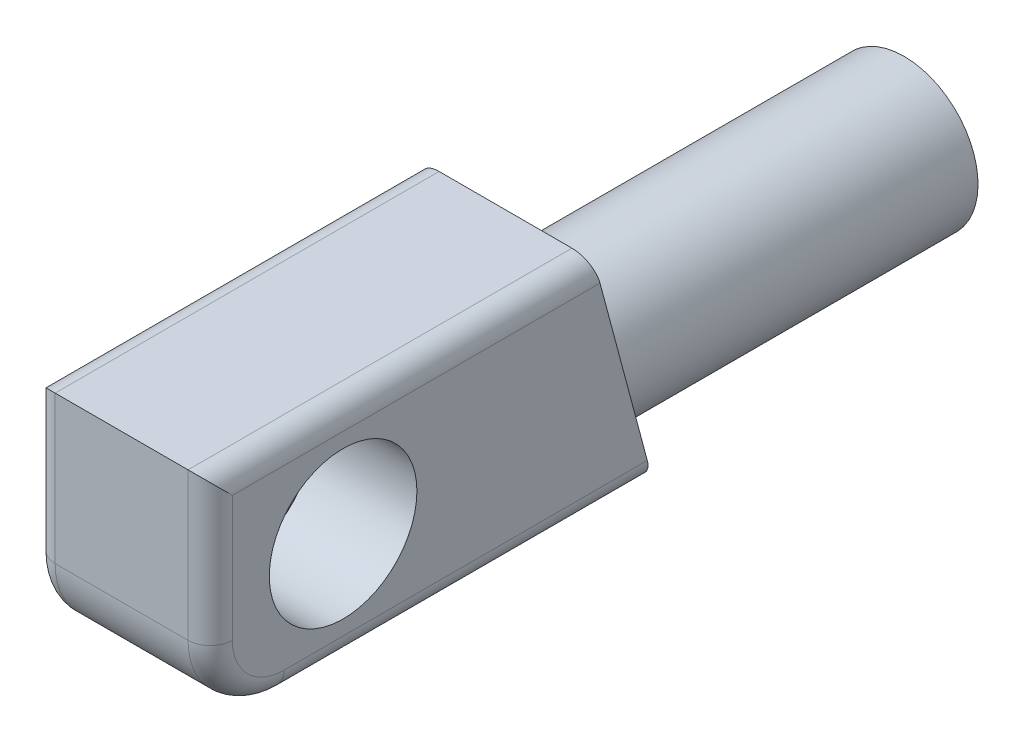
ISO-10303-21;
HEADER;
FILE_DESCRIPTION(('STEP AP214'),'2;1');
FILE_NAME('part.step','',(''),(''),'','','');
FILE_SCHEMA(('AUTOMOTIVE_DESIGN { 1 0 10303 214 1 1 1 1 }'));
ENDSEC;
DATA;
#1=APPLICATION_CONTEXT('core data for automotive mechanical design processes');
#2=APPLICATION_PROTOCOL_DEFINITION('international standard','automotive_design',2000,#1);
#3=PRODUCT_CONTEXT('',#1,'mechanical');
#4=PRODUCT('Part','Part','',(#3));
#5=PRODUCT_RELATED_PRODUCT_CATEGORY('part','',(#4));
#6=PRODUCT_DEFINITION_FORMATION('','',#4);
#7=PRODUCT_DEFINITION_CONTEXT('part definition',#1,'design');
#8=PRODUCT_DEFINITION('design','',#6,#7);
#9=PRODUCT_DEFINITION_SHAPE('','',#8);
#10=(LENGTH_UNIT() NAMED_UNIT(*) SI_UNIT(.MILLI.,.METRE.));
#11=(NAMED_UNIT(*) PLANE_ANGLE_UNIT() SI_UNIT($,.RADIAN.));
#12=(NAMED_UNIT(*) SI_UNIT($,.STERADIAN.) SOLID_ANGLE_UNIT());
#13=UNCERTAINTY_MEASURE_WITH_UNIT(LENGTH_MEASURE(1.E-05),#10,'distance_accuracy_value','');
#14=(GEOMETRIC_REPRESENTATION_CONTEXT(3) GLOBAL_UNCERTAINTY_ASSIGNED_CONTEXT((#13)) GLOBAL_UNIT_ASSIGNED_CONTEXT((#10,
#11,#12)) REPRESENTATION_CONTEXT('',''));
#15=CARTESIAN_POINT('',(0.,0.,0.));
#16=DIRECTION('',(0.,0.,1.));
#17=DIRECTION('',(1.,0.,0.));
#18=AXIS2_PLACEMENT_3D('',#15,#16,#17);
#19=CARTESIAN_POINT('',(5.99999999999999,7.50000000000001,13.0000000000001));
#20=DIRECTION('',(0.,-1.,0.));
#21=DIRECTION('',(0.,0.,-1.));
#22=AXIS2_PLACEMENT_3D('',#19,#20,#21);
#23=PLANE('',#22);
#24=DIRECTION('',(-1.,0.,0.));
#25=VECTOR('',#24,1.);
#26=CARTESIAN_POINT('',(5.99999999999999,7.50000000000001,13.0000000000001));
#27=LINE('',#26,#25);
#28=CARTESIAN_POINT('',(4.5,7.50000000000001,13.0000000000001));
#29=VERTEX_POINT('',#28);
#30=CARTESIAN_POINT('',(-4.5,7.50000000000001,13.0000000000001));
#31=VERTEX_POINT('',#30);
#32=EDGE_CURVE('E205',#29,#31,#27,.T.);
#33=ORIENTED_EDGE('',*,*,#32,.F.);
#34=DIRECTION('',(0.,0.,1.));
#35=VECTOR('',#34,1.);
#36=CARTESIAN_POINT('',(4.5,7.50000000000001,13.0000000000001));
#37=LINE('',#36,#35);
#38=CARTESIAN_POINT('',(4.5,7.50000000000013,-13.0000000000001));
#39=VERTEX_POINT('',#38);
#40=EDGE_CURVE('E13',#29,#39,#37,.F.);
#41=ORIENTED_EDGE('',*,*,#40,.T.);
#42=DIRECTION('',(-1.,0.,0.));
#43=VECTOR('',#42,1.);
#44=CARTESIAN_POINT('',(5.99999999999987,7.50000000000013,-13.));
#45=LINE('',#44,#43);
#46=CARTESIAN_POINT('',(-4.50000000000002,7.50000000000013,-13.));
#47=VERTEX_POINT('',#46);
#48=EDGE_CURVE('E197',#39,#47,#45,.T.);
#49=ORIENTED_EDGE('',*,*,#48,.T.);
#50=DIRECTION('',(0.,0.,1.));
#51=VECTOR('',#50,1.);
#52=CARTESIAN_POINT('',(-4.5,7.50000000000001,13.0000000000001));
#53=LINE('',#52,#51);
#54=EDGE_CURVE('E61',#47,#31,#53,.T.);
#55=ORIENTED_EDGE('',*,*,#54,.T.);
#56=EDGE_LOOP('',(#33,#41,#49,#55));
#57=FACE_BOUND('',#56,.T.);
#58=ADVANCED_FACE('F52',(#57),#23,.F.);
#59=CARTESIAN_POINT('',(5.99999999999999,7.50000000000001,13.0000000000001));
#60=DIRECTION('',(0.,0.,-1.));
#61=DIRECTION('',(0.,1.,0.));
#62=AXIS2_PLACEMENT_3D('',#59,#60,#61);
#63=PLANE('',#62);
#64=DIRECTION('',(-1.,0.,0.));
#65=VECTOR('',#64,1.);
#66=CARTESIAN_POINT('',(5.99999999999999,-2.49999999999999,13.0000000000001));
#67=LINE('',#66,#65);
#68=CARTESIAN_POINT('',(-4.50000000000014,-2.5,13.));
#69=VERTEX_POINT('',#68);
#70=CARTESIAN_POINT('',(4.50000000000002,-2.49999999999999,13.0000000000001));
#71=VERTEX_POINT('',#70);
#72=EDGE_CURVE('E220',#69,#71,#67,.F.);
#73=ORIENTED_EDGE('',*,*,#72,.T.);
#74=DIRECTION('',(0.,-1.,0.));
#75=VECTOR('',#74,1.);
#76=CARTESIAN_POINT('',(4.5,7.50000000000001,13.0000000000001));
#77=LINE('',#76,#75);
#78=EDGE_CURVE('E234',#71,#29,#77,.F.);
#79=ORIENTED_EDGE('',*,*,#78,.T.);
#80=ORIENTED_EDGE('',*,*,#32,.T.);
#81=DIRECTION('',(0.,-1.,0.));
#82=VECTOR('',#81,1.);
#83=CARTESIAN_POINT('',(-4.50000000000014,-2.5,13.));
#84=LINE('',#83,#82);
#85=EDGE_CURVE('E232',#31,#69,#84,.T.);
#86=ORIENTED_EDGE('',*,*,#85,.T.);
#87=EDGE_LOOP('',(#73,#79,#80,#86));
#88=FACE_BOUND('',#87,.T.);
#89=ADVANCED_FACE('F308',(#88),#63,.F.);
#90=CARTESIAN_POINT('',(5.99999999999999,-7.49999999999999,13.));
#91=DIRECTION('',(0.,1.,0.));
#92=DIRECTION('',(0.,0.,1.));
#93=AXIS2_PLACEMENT_3D('',#90,#91,#92);
#94=PLANE('',#93);
#95=DIRECTION('',(-1.,0.,0.));
#96=VECTOR('',#95,1.);
#97=CARTESIAN_POINT('',(5.99999999999987,-7.49999999999987,8.00000000000003));
#98=LINE('',#97,#96);
#99=CARTESIAN_POINT('',(4.5,-7.49999999999987,8.00000000000003));
#100=VERTEX_POINT('',#99);
#101=CARTESIAN_POINT('',(-4.50000000000013,-7.49999999999987,8.00000000000003));
#102=VERTEX_POINT('',#101);
#103=EDGE_CURVE('E217',#100,#102,#98,.T.);
#104=ORIENTED_EDGE('',*,*,#103,.T.);
#105=DIRECTION('',(0.,0.,-1.));
#106=VECTOR('',#105,1.);
#107=CARTESIAN_POINT('',(-4.5,-7.49999999999987,-17.0000000000001));
#108=LINE('',#107,#106);
#109=CARTESIAN_POINT('',(-4.5,-7.49999999999987,-17.0000000000001));
#110=VERTEX_POINT('',#109);
#111=EDGE_CURVE('E242',#102,#110,#108,.T.);
#112=ORIENTED_EDGE('',*,*,#111,.T.);
#113=DIRECTION('',(-1.,0.,0.));
#114=VECTOR('',#113,1.);
#115=CARTESIAN_POINT('',(6.00000000000013,-7.49999999999987,-17.));
#116=LINE('',#115,#114);
#117=CARTESIAN_POINT('',(-1.00000000000014,-7.49999999999987,-17.));
#118=VERTEX_POINT('',#117);
#119=EDGE_CURVE('E202',#118,#110,#116,.T.);
#120=ORIENTED_EDGE('',*,*,#119,.F.);
#121=DIRECTION('',(0.,0.,1.));
#122=VECTOR('',#121,1.);
#123=CARTESIAN_POINT('',(-1.00000000000003,-7.49999999999999,-40.0000000000001));
#124=LINE('',#123,#122);
#125=CARTESIAN_POINT('',(-1.00000000000003,-7.49999999999999,-40.0000000000001));
#126=VERTEX_POINT('',#125);
#127=EDGE_CURVE('E191',#126,#118,#124,.T.);
#128=ORIENTED_EDGE('',*,*,#127,.F.);
#129=DIRECTION('',(1.,0.,0.));
#130=VECTOR('',#129,1.);
#131=CARTESIAN_POINT('',(0.,-7.49999999999999,-40.0000000000001));
#132=LINE('',#131,#130);
#133=CARTESIAN_POINT('',(1.,-7.49999999999999,-40.0000000000001));
#134=VERTEX_POINT('',#133);
#135=EDGE_CURVE('E165',#126,#134,#132,.T.);
#136=ORIENTED_EDGE('',*,*,#135,.T.);
#137=DIRECTION('',(0.,0.,1.));
#138=VECTOR('',#137,1.);
#139=CARTESIAN_POINT('',(1.,-7.49999999999999,-40.0000000000001));
#140=LINE('',#139,#138);
#141=CARTESIAN_POINT('',(0.999999999999862,-7.49999999999987,-17.));
#142=VERTEX_POINT('',#141);
#143=EDGE_CURVE('E179',#134,#142,#140,.T.);
#144=ORIENTED_EDGE('',*,*,#143,.T.);
#145=CARTESIAN_POINT('',(4.49999999999998,-7.49999999999987,-17.));
#146=VERTEX_POINT('',#145);
#147=EDGE_CURVE('E203',#146,#142,#116,.T.);
#148=ORIENTED_EDGE('',*,*,#147,.F.);
#149=DIRECTION('',(0.,0.,-1.));
#150=VECTOR('',#149,1.);
#151=CARTESIAN_POINT('',(4.50000000000012,-7.49999999999999,13.));
#152=LINE('',#151,#150);
#153=EDGE_CURVE('E240',#146,#100,#152,.F.);
#154=ORIENTED_EDGE('',*,*,#153,.T.);
#155=EDGE_LOOP('',(#104,#112,#120,#128,#136,#144,#148,#154));
#156=FACE_BOUND('',#155,.T.);
#157=ADVANCED_FACE('F295',(#156),#94,.F.);
#158=CARTESIAN_POINT('',(5.99999999999987,7.50000000000013,-13.));
#159=DIRECTION('',(0.,-0.257662650560332,0.966234939601251));
#160=DIRECTION('',(0.,-0.966234939601246,-0.257662650560333));
#161=AXIS2_PLACEMENT_3D('',#158,#159,#160);
#162=PLANE('',#161);
#163=ORIENTED_EDGE('',*,*,#119,.T.);
#164=CARTESIAN_POINT('',(-4.5,-5.99999999999987,-16.6000000000001));
#165=DIRECTION('',(0.,-0.257662650560332,0.966234939601251));
#166=DIRECTION('',(0.,0.966234939601246,0.257662650560333));
#167=AXIS2_PLACEMENT_3D('',#164,#165,#166);
#168=ELLIPSE('',#167,1.552417469626,1.5);
#169=CARTESIAN_POINT('',(-6.00000000000001,-5.99999999999987,-16.6000000000001));
#170=VERTEX_POINT('',#169);
#171=EDGE_CURVE('E251',#110,#170,#168,.F.);
#172=ORIENTED_EDGE('',*,*,#171,.T.);
#173=DIRECTION('',(0.,0.966234939601246,0.257662650560333));
#174=VECTOR('',#173,1.);
#175=CARTESIAN_POINT('',(-6.00000000000013,7.50000000000013,-13.));
#176=LINE('',#175,#174);
#177=CARTESIAN_POINT('',(-6.00000000000013,6.00000000000013,-13.4000000000001));
#178=VERTEX_POINT('',#177);
#179=EDGE_CURVE('E190',#170,#178,#176,.T.);
#180=ORIENTED_EDGE('',*,*,#179,.T.);
#181=CARTESIAN_POINT('',(-4.50000000000003,6.00000000000013,-13.4));
#182=DIRECTION('',(0.,-0.257662650560332,0.966234939601251));
#183=DIRECTION('',(0.,-0.966234939601246,-0.257662650560333));
#184=AXIS2_PLACEMENT_3D('',#181,#182,#183);
#185=ELLIPSE('',#184,1.552417469626,1.5);
#186=EDGE_CURVE('E245',#178,#47,#185,.F.);
#187=ORIENTED_EDGE('',*,*,#186,.T.);
#188=ORIENTED_EDGE('',*,*,#48,.F.);
#189=CARTESIAN_POINT('',(4.5,6.00000000000013,-13.4000000000001));
#190=DIRECTION('',(0.,-0.257662650560332,0.966234939601251));
#191=DIRECTION('',(0.,0.966234939601246,0.257662650560333));
#192=AXIS2_PLACEMENT_3D('',#189,#190,#191);
#193=ELLIPSE('',#192,1.552417469626,1.5);
#194=CARTESIAN_POINT('',(5.99999999999987,6.00000000000013,-13.4));
#195=VERTEX_POINT('',#194);
#196=EDGE_CURVE('E247',#39,#195,#193,.F.);
#197=ORIENTED_EDGE('',*,*,#196,.T.);
#198=DIRECTION('',(0.,0.966234939601246,0.257662650560333));
#199=VECTOR('',#198,1.);
#200=CARTESIAN_POINT('',(5.99999999999987,7.50000000000013,-13.));
#201=LINE('',#200,#199);
#202=CARTESIAN_POINT('',(5.99999999999999,-5.99999999999985,-16.6000000000001));
#203=VERTEX_POINT('',#202);
#204=EDGE_CURVE('E194',#203,#195,#201,.T.);
#205=ORIENTED_EDGE('',*,*,#204,.F.);
#206=CARTESIAN_POINT('',(4.49999999999986,-5.99999999999987,-16.6000000000001));
#207=DIRECTION('',(0.,-0.257662650560332,0.966234939601251));
#208=DIRECTION('',(0.,-0.966234939601246,-0.257662650560333));
#209=AXIS2_PLACEMENT_3D('',#206,#207,#208);
#210=ELLIPSE('',#209,1.552417469626,1.5);
#211=EDGE_CURVE('E249',#203,#146,#210,.F.);
#212=ORIENTED_EDGE('',*,*,#211,.T.);
#213=ORIENTED_EDGE('',*,*,#147,.T.);
#214=DIRECTION('',(0.,0.966234939601246,0.257662650560333));
#215=VECTOR('',#214,1.);
#216=CARTESIAN_POINT('',(0.999999999999862,7.50000000000013,-13.));
#217=LINE('',#216,#215);
#218=CARTESIAN_POINT('',(0.999999999999862,-6.89897948556623,-16.8397278628177));
#219=VERTEX_POINT('',#218);
#220=EDGE_CURVE('E212',#142,#219,#217,.T.);
#221=ORIENTED_EDGE('',*,*,#220,.T.);
#222=CARTESIAN_POINT('',(0.,-1.99999999999986,-15.5333333333334));
#223=DIRECTION('',(0.,-0.257662650560332,0.966234939601251));
#224=DIRECTION('',(0.,0.966234939601246,0.257662650560333));
#225=AXIS2_PLACEMENT_3D('',#222,#223,#224);
#226=ELLIPSE('',#225,5.17472489875334,5.);
#227=CARTESIAN_POINT('',(-1.00000000000014,-6.89897948556623,-16.8397278628177));
#228=VERTEX_POINT('',#227);
#229=EDGE_CURVE('E159',#219,#228,#226,.T.);
#230=ORIENTED_EDGE('',*,*,#229,.T.);
#231=DIRECTION('',(0.,0.966234939601246,0.257662650560333));
#232=VECTOR('',#231,1.);
#233=CARTESIAN_POINT('',(-1.00000000000014,7.50000000000013,-13.));
#234=LINE('',#233,#232);
#235=EDGE_CURVE('E209',#118,#228,#234,.T.);
#236=ORIENTED_EDGE('',*,*,#235,.F.);
#237=EDGE_LOOP('',(#163,#172,#180,#187,#188,#197,#205,#212,#213,#221,#230,#236));
#238=FACE_BOUND('',#237,.T.);
#239=ADVANCED_FACE('F287',(#238),#162,.F.);
#240=CARTESIAN_POINT('',(6.00000000000001,0.,0.));
#241=DIRECTION('',(-1.,0.,0.));
#242=DIRECTION('',(0.,0.,1.));
#243=AXIS2_PLACEMENT_3D('',#240,#241,#242);
#244=PLANE('',#243);
#245=CARTESIAN_POINT('',(6.00000000000001,1.38777878078145E-13,4.00000000000002));
#246=DIRECTION('',(1.,0.,0.));
#247=DIRECTION('',(0.,0.,-1.));
#248=AXIS2_PLACEMENT_3D('',#245,#246,#247);
#249=CIRCLE('',#248,5.);
#250=CARTESIAN_POINT('',(6.00000000000001,1.38777878078145E-13,-1.00000000000001));
#251=VERTEX_POINT('',#250);
#252=EDGE_CURVE('E183',#251,#251,#249,.T.);
#253=ORIENTED_EDGE('',*,*,#252,.F.);
#254=EDGE_LOOP('',(#253));
#255=FACE_BOUND('',#254,.T.);
#256=CARTESIAN_POINT('',(5.99999999999987,-2.49999999999986,8.00000000000003));
#257=DIRECTION('',(-1.,0.,0.));
#258=DIRECTION('',(0.,0.,1.));
#259=AXIS2_PLACEMENT_3D('',#256,#257,#258);
#260=CIRCLE('',#259,3.5);
#261=CARTESIAN_POINT('',(5.99999999999999,-2.49999999999997,11.5000000000001));
#262=VERTEX_POINT('',#261);
#263=CARTESIAN_POINT('',(5.99999999999987,-5.99999999999987,8.00000000000003));
#264=VERTEX_POINT('',#263);
#265=EDGE_CURVE('E228',#262,#264,#260,.F.);
#266=ORIENTED_EDGE('',*,*,#265,.T.);
#267=DIRECTION('',(0.,0.,-1.));
#268=VECTOR('',#267,1.);
#269=CARTESIAN_POINT('',(6.00000000000013,-5.99999999999999,0.));
#270=LINE('',#269,#268);
#271=EDGE_CURVE('E230',#264,#203,#270,.T.);
#272=ORIENTED_EDGE('',*,*,#271,.T.);
#273=ORIENTED_EDGE('',*,*,#204,.T.);
#274=DIRECTION('',(0.,0.,1.));
#275=VECTOR('',#274,1.);
#276=CARTESIAN_POINT('',(6.00000000000001,6.00000000000001,0.));
#277=LINE('',#276,#275);
#278=CARTESIAN_POINT('',(5.99999999999999,6.00000000000001,11.5));
#279=VERTEX_POINT('',#278);
#280=EDGE_CURVE('E223',#195,#279,#277,.T.);
#281=ORIENTED_EDGE('',*,*,#280,.T.);
#282=DIRECTION('',(0.,-1.,0.));
#283=VECTOR('',#282,1.);
#284=CARTESIAN_POINT('',(5.99999999999999,0.,11.5000000000001));
#285=LINE('',#284,#283);
#286=EDGE_CURVE('E225',#279,#262,#285,.T.);
#287=ORIENTED_EDGE('',*,*,#286,.T.);
#288=EDGE_LOOP('',(#266,#272,#273,#281,#287));
#289=FACE_BOUND('',#288,.T.);
#290=ADVANCED_FACE('F320',(#255,#289),#244,.F.);
#291=CARTESIAN_POINT('',(-6.00000000000001,0.,0.));
#292=DIRECTION('',(-1.,0.,0.));
#293=DIRECTION('',(0.,0.,1.));
#294=AXIS2_PLACEMENT_3D('',#291,#292,#293);
#295=PLANE('',#294);
#296=ORIENTED_EDGE('',*,*,#179,.F.);
#297=DIRECTION('',(0.,0.,-1.));
#298=VECTOR('',#297,1.);
#299=CARTESIAN_POINT('',(-6.00000000000013,-5.99999999999987,8.00000000000003));
#300=LINE('',#299,#298);
#301=CARTESIAN_POINT('',(-6.00000000000013,-5.99999999999987,8.00000000000003));
#302=VERTEX_POINT('',#301);
#303=EDGE_CURVE('E69',#170,#302,#300,.F.);
#304=ORIENTED_EDGE('',*,*,#303,.T.);
#305=CARTESIAN_POINT('',(-6.00000000000013,-2.49999999999986,8.00000000000003));
#306=DIRECTION('',(-1.,0.,0.));
#307=DIRECTION('',(0.,0.,1.));
#308=AXIS2_PLACEMENT_3D('',#305,#306,#307);
#309=CIRCLE('',#308,3.5);
#310=CARTESIAN_POINT('',(-6.00000000000001,-2.49999999999999,11.5000000000001));
#311=VERTEX_POINT('',#310);
#312=EDGE_CURVE('E256',#302,#311,#309,.T.);
#313=ORIENTED_EDGE('',*,*,#312,.T.);
#314=DIRECTION('',(0.,-1.,0.));
#315=VECTOR('',#314,1.);
#316=CARTESIAN_POINT('',(-6.00000000000001,7.50000000000001,11.5));
#317=LINE('',#316,#315);
#318=CARTESIAN_POINT('',(-6.00000000000001,6.00000000000001,11.5000000000001));
#319=VERTEX_POINT('',#318);
#320=EDGE_CURVE('E75',#311,#319,#317,.F.);
#321=ORIENTED_EDGE('',*,*,#320,.T.);
#322=DIRECTION('',(0.,0.,1.));
#323=VECTOR('',#322,1.);
#324=CARTESIAN_POINT('',(-6.00000000000013,6.00000000000013,-13.));
#325=LINE('',#324,#323);
#326=EDGE_CURVE('E254',#319,#178,#325,.F.);
#327=ORIENTED_EDGE('',*,*,#326,.T.);
#328=EDGE_LOOP('',(#296,#304,#313,#321,#327));
#329=FACE_BOUND('',#328,.T.);
#330=ADVANCED_FACE('F284',(#329),#295,.T.);
#331=CARTESIAN_POINT('',(1.,0.,-40.0000000000001));
#332=DIRECTION('',(1.,0.,0.));
#333=DIRECTION('',(0.,0.,-1.));
#334=AXIS2_PLACEMENT_3D('',#331,#332,#333);
#335=PLANE('',#334);
#336=ORIENTED_EDGE('',*,*,#220,.F.);
#337=ORIENTED_EDGE('',*,*,#143,.F.);
#338=DIRECTION('',(0.,1.,0.));
#339=VECTOR('',#338,1.);
#340=CARTESIAN_POINT('',(1.,0.,-40.0000000000001));
#341=LINE('',#340,#339);
#342=CARTESIAN_POINT('',(1.,-6.89897948556635,-40.0000000000001));
#343=VERTEX_POINT('',#342);
#344=EDGE_CURVE('E171',#134,#343,#341,.T.);
#345=ORIENTED_EDGE('',*,*,#344,.T.);
#346=DIRECTION('',(0.,0.,1.));
#347=VECTOR('',#346,1.);
#348=CARTESIAN_POINT('',(1.,-6.89897948556635,-40.0000000000001));
#349=LINE('',#348,#347);
#350=EDGE_CURVE('E154',#343,#219,#349,.T.);
#351=ORIENTED_EDGE('',*,*,#350,.T.);
#352=EDGE_LOOP('',(#336,#337,#345,#351));
#353=FACE_BOUND('',#352,.T.);
#354=ADVANCED_FACE('F177',(#353),#335,.T.);
#355=CARTESIAN_POINT('',(-1.,0.,-40.0000000000001));
#356=DIRECTION('',(1.,0.,0.));
#357=DIRECTION('',(0.,0.,-1.));
#358=AXIS2_PLACEMENT_3D('',#355,#356,#357);
#359=PLANE('',#358);
#360=ORIENTED_EDGE('',*,*,#127,.T.);
#361=ORIENTED_EDGE('',*,*,#235,.T.);
#362=DIRECTION('',(0.,0.,1.));
#363=VECTOR('',#362,1.);
#364=CARTESIAN_POINT('',(-1.00000000000001,-6.89897948556635,-40.0000000000001));
#365=LINE('',#364,#363);
#366=CARTESIAN_POINT('',(-1.00000000000001,-6.89897948556635,-40.0000000000001));
#367=VERTEX_POINT('',#366);
#368=EDGE_CURVE('E164',#367,#228,#365,.T.);
#369=ORIENTED_EDGE('',*,*,#368,.F.);
#370=DIRECTION('',(0.,1.,0.));
#371=VECTOR('',#370,1.);
#372=CARTESIAN_POINT('',(-1.,0.,-40.0000000000001));
#373=LINE('',#372,#371);
#374=EDGE_CURVE('E174',#126,#367,#373,.T.);
#375=ORIENTED_EDGE('',*,*,#374,.F.);
#376=EDGE_LOOP('',(#360,#361,#369,#375));
#377=FACE_BOUND('',#376,.T.);
#378=ADVANCED_FACE('F431',(#377),#359,.F.);
#379=CARTESIAN_POINT('',(0.,-2.,-40.0000000000001));
#380=DIRECTION('',(0.,0.,1.));
#381=DIRECTION('',(1.,0.,0.));
#382=AXIS2_PLACEMENT_3D('',#379,#380,#381);
#383=CYLINDRICAL_SURFACE('',#382,4.);
#384=CARTESIAN_POINT('',(0.,-2.,-40.0000000000001));
#385=DIRECTION('',(0.,0.,1.));
#386=DIRECTION('',(1.,0.,0.));
#387=AXIS2_PLACEMENT_3D('',#384,#385,#386);
#388=CIRCLE('',#387,4.);
#389=CARTESIAN_POINT('',(4.00000000000002,-2.,-40.0000000000001));
#390=VERTEX_POINT('',#389);
#391=EDGE_CURVE('E180',#390,#390,#388,.T.);
#392=ORIENTED_EDGE('',*,*,#391,.F.);
#393=EDGE_LOOP('',(#392));
#394=FACE_BOUND('',#393,.T.);
#395=CARTESIAN_POINT('',(0.,-1.99999999999986,-15.5333333333334));
#396=DIRECTION('',(0.,-0.257662650560332,0.966234939601251));
#397=DIRECTION('',(0.,0.966234939601246,0.257662650560333));
#398=AXIS2_PLACEMENT_3D('',#395,#396,#397);
#399=ELLIPSE('',#398,4.13977991900267,4.);
#400=CARTESIAN_POINT('',(0.,2.00000000000014,-14.4666666666667));
#401=VERTEX_POINT('',#400);
#402=EDGE_CURVE('E214',#401,#401,#399,.T.);
#403=ORIENTED_EDGE('',*,*,#402,.T.);
#404=EDGE_LOOP('',(#403));
#405=FACE_BOUND('',#404,.T.);
#406=ADVANCED_FACE('F424',(#394,#405),#383,.F.);
#407=CARTESIAN_POINT('',(0.,-2.,-40.0000000000001));
#408=DIRECTION('',(0.,0.,1.));
#409=DIRECTION('',(1.,0.,0.));
#410=AXIS2_PLACEMENT_3D('',#407,#408,#409);
#411=CYLINDRICAL_SURFACE('',#410,5.);
#412=ORIENTED_EDGE('',*,*,#229,.F.);
#413=ORIENTED_EDGE('',*,*,#350,.F.);
#414=CARTESIAN_POINT('',(0.,-2.,-40.0000000000001));
#415=DIRECTION('',(0.,0.,1.));
#416=DIRECTION('',(1.,0.,0.));
#417=AXIS2_PLACEMENT_3D('',#414,#415,#416);
#418=CIRCLE('',#417,5.);
#419=EDGE_CURVE('E157',#343,#367,#418,.T.);
#420=ORIENTED_EDGE('',*,*,#419,.T.);
#421=ORIENTED_EDGE('',*,*,#368,.T.);
#422=EDGE_LOOP('',(#412,#413,#420,#421));
#423=FACE_BOUND('',#422,.T.);
#424=ADVANCED_FACE('F156',(#423),#411,.T.);
#425=CARTESIAN_POINT('',(0.,0.,-40.0000000000001));
#426=DIRECTION('',(0.,0.,1.));
#427=DIRECTION('',(1.,0.,0.));
#428=AXIS2_PLACEMENT_3D('',#425,#426,#427);
#429=PLANE('',#428);
#430=ORIENTED_EDGE('',*,*,#391,.T.);
#431=EDGE_LOOP('',(#430));
#432=FACE_BOUND('',#431,.T.);
#433=ORIENTED_EDGE('',*,*,#344,.F.);
#434=ORIENTED_EDGE('',*,*,#135,.F.);
#435=ORIENTED_EDGE('',*,*,#374,.T.);
#436=ORIENTED_EDGE('',*,*,#419,.F.);
#437=EDGE_LOOP('',(#433,#434,#435,#436));
#438=FACE_BOUND('',#437,.T.);
#439=ADVANCED_FACE('F169',(#432,#438),#429,.F.);
#440=ORIENTED_EDGE('',*,*,#402,.F.);
#441=EDGE_LOOP('',(#440));
#442=FACE_BOUND('',#441,.T.);
#443=ADVANCED_FACE('F408',(#442),#162,.F.);
#444=CARTESIAN_POINT('',(6.00000000000001,1.38777878078145E-13,4.00000000000002));
#445=DIRECTION('',(-1.,0.,0.));
#446=DIRECTION('',(0.,0.,1.));
#447=AXIS2_PLACEMENT_3D('',#444,#445,#446);
#448=CYLINDRICAL_SURFACE('',#447,5.);
#449=ORIENTED_EDGE('',*,*,#252,.T.);
#450=EDGE_LOOP('',(#449));
#451=FACE_BOUND('',#450,.T.);
#452=CARTESIAN_POINT('',(-1.00000000000014,1.38777878078145E-13,4.00000000000002));
#453=DIRECTION('',(1.,0.,0.));
#454=DIRECTION('',(0.,0.,-1.));
#455=AXIS2_PLACEMENT_3D('',#452,#453,#454);
#456=CIRCLE('',#455,5.);
#457=CARTESIAN_POINT('',(-1.00000000000014,1.38777878078145E-13,-1.));
#458=VERTEX_POINT('',#457);
#459=EDGE_CURVE('E268',#458,#458,#456,.T.);
#460=ORIENTED_EDGE('',*,*,#459,.F.);
#461=EDGE_LOOP('',(#460));
#462=FACE_BOUND('',#461,.T.);
#463=ADVANCED_FACE('F400',(#451,#462),#448,.F.);
#464=CARTESIAN_POINT('',(-1.00000000000014,1.38777878078145E-13,4.00000000000002));
#465=DIRECTION('',(1.,0.,0.));
#466=DIRECTION('',(0.,0.,-1.));
#467=AXIS2_PLACEMENT_3D('',#464,#465,#466);
#468=PLANE('',#467);
#469=ORIENTED_EDGE('',*,*,#459,.T.);
#470=EDGE_LOOP('',(#469));
#471=FACE_BOUND('',#470,.T.);
#472=ADVANCED_FACE('F338',(#471),#468,.T.);
#473=CARTESIAN_POINT('',(5.99999999999987,-2.49999999999986,8.00000000000003));
#474=DIRECTION('',(-1.,0.,0.));
#475=DIRECTION('',(0.,0.,1.));
#476=AXIS2_PLACEMENT_3D('',#473,#474,#475);
#477=CYLINDRICAL_SURFACE('',#476,5.);
#478=ORIENTED_EDGE('',*,*,#103,.F.);
#479=CARTESIAN_POINT('',(4.5,-2.49999999999986,8.00000000000003));
#480=DIRECTION('',(-1.,0.,0.));
#481=DIRECTION('',(0.,0.,1.));
#482=AXIS2_PLACEMENT_3D('',#479,#480,#481);
#483=CIRCLE('',#482,5.);
#484=EDGE_CURVE('E238',#100,#71,#483,.T.);
#485=ORIENTED_EDGE('',*,*,#484,.T.);
#486=ORIENTED_EDGE('',*,*,#72,.F.);
#487=CARTESIAN_POINT('',(-4.50000000000013,-2.49999999999986,8.00000000000003));
#488=DIRECTION('',(-1.,0.,0.));
#489=DIRECTION('',(0.,0.,1.));
#490=AXIS2_PLACEMENT_3D('',#487,#488,#489);
#491=CIRCLE('',#490,5.);
#492=EDGE_CURVE('E236',#69,#102,#491,.F.);
#493=ORIENTED_EDGE('',*,*,#492,.T.);
#494=EDGE_LOOP('',(#478,#485,#486,#493));
#495=FACE_BOUND('',#494,.T.);
#496=ADVANCED_FACE('F304',(#495),#477,.T.);
#497=CARTESIAN_POINT('',(4.49999999999986,-5.99999999999999,0.));
#498=DIRECTION('',(0.,0.,-1.));
#499=DIRECTION('',(-1.,0.,0.));
#500=AXIS2_PLACEMENT_3D('',#497,#498,#499);
#501=CYLINDRICAL_SURFACE('',#500,1.5);
#502=ORIENTED_EDGE('',*,*,#211,.F.);
#503=ORIENTED_EDGE('',*,*,#271,.F.);
#504=CARTESIAN_POINT('',(4.5,-5.99999999999987,8.00000000000003));
#505=DIRECTION('',(0.,0.,1.));
#506=DIRECTION('',(1.,0.,0.));
#507=AXIS2_PLACEMENT_3D('',#504,#505,#506);
#508=CIRCLE('',#507,1.5);
#509=EDGE_CURVE('E265',#100,#264,#508,.T.);
#510=ORIENTED_EDGE('',*,*,#509,.F.);
#511=ORIENTED_EDGE('',*,*,#153,.F.);
#512=EDGE_LOOP('',(#502,#503,#510,#511));
#513=FACE_BOUND('',#512,.T.);
#514=ADVANCED_FACE('F330',(#513),#501,.T.);
#515=CARTESIAN_POINT('',(4.49999999999986,6.00000000000001,0.));
#516=DIRECTION('',(0.,0.,1.));
#517=DIRECTION('',(1.,0.,0.));
#518=AXIS2_PLACEMENT_3D('',#515,#516,#517);
#519=CYLINDRICAL_SURFACE('',#518,1.5);
#520=ORIENTED_EDGE('',*,*,#196,.F.);
#521=ORIENTED_EDGE('',*,*,#40,.F.);
#522=CARTESIAN_POINT('',(4.49999999999999,6.00000000000001,11.5000000000001));
#523=DIRECTION('',(0.,-0.707106781186548,0.707106781186551));
#524=DIRECTION('',(0.,0.707106781186547,0.707106781186551));
#525=AXIS2_PLACEMENT_3D('',#522,#523,#524);
#526=ELLIPSE('',#525,2.12132034355964,1.5);
#527=EDGE_CURVE('E262',#279,#29,#526,.T.);
#528=ORIENTED_EDGE('',*,*,#527,.F.);
#529=ORIENTED_EDGE('',*,*,#280,.F.);
#530=EDGE_LOOP('',(#520,#521,#528,#529));
#531=FACE_BOUND('',#530,.T.);
#532=ADVANCED_FACE('F326',(#531),#519,.T.);
#533=CARTESIAN_POINT('',(4.5,-2.49999999999986,8.00000000000003));
#534=DIRECTION('',(-1.,0.,0.));
#535=DIRECTION('',(0.,0.,1.));
#536=AXIS2_PLACEMENT_3D('',#533,#534,#535);
#537=TOROIDAL_SURFACE('',#536,3.5,1.5);
#538=ORIENTED_EDGE('',*,*,#509,.T.);
#539=ORIENTED_EDGE('',*,*,#265,.F.);
#540=CARTESIAN_POINT('',(4.5,-2.49999999999999,11.5));
#541=DIRECTION('',(0.,1.,0.));
#542=DIRECTION('',(0.,0.,1.));
#543=AXIS2_PLACEMENT_3D('',#540,#541,#542);
#544=CIRCLE('',#543,1.5);
#545=EDGE_CURVE('E260',#71,#262,#544,.T.);
#546=ORIENTED_EDGE('',*,*,#545,.F.);
#547=ORIENTED_EDGE('',*,*,#484,.F.);
#548=EDGE_LOOP('',(#538,#539,#546,#547));
#549=FACE_BOUND('',#548,.T.);
#550=ADVANCED_FACE('F317',(#549),#537,.T.);
#551=CARTESIAN_POINT('',(4.5,0.,11.5));
#552=DIRECTION('',(0.,-1.,0.));
#553=DIRECTION('',(0.,0.,-1.));
#554=AXIS2_PLACEMENT_3D('',#551,#552,#553);
#555=CYLINDRICAL_SURFACE('',#554,1.5);
#556=ORIENTED_EDGE('',*,*,#527,.T.);
#557=ORIENTED_EDGE('',*,*,#78,.F.);
#558=ORIENTED_EDGE('',*,*,#545,.T.);
#559=ORIENTED_EDGE('',*,*,#286,.F.);
#560=EDGE_LOOP('',(#556,#557,#558,#559));
#561=FACE_BOUND('',#560,.T.);
#562=ADVANCED_FACE('F312',(#561),#555,.T.);
#563=CARTESIAN_POINT('',(-4.5,6.00000000000001,13.));
#564=DIRECTION('',(0.,0.,-1.));
#565=DIRECTION('',(-1.,0.,0.));
#566=AXIS2_PLACEMENT_3D('',#563,#564,#565);
#567=CYLINDRICAL_SURFACE('',#566,1.5);
#568=ORIENTED_EDGE('',*,*,#186,.F.);
#569=ORIENTED_EDGE('',*,*,#326,.F.);
#570=CARTESIAN_POINT('',(-4.5,6.00000000000001,11.5));
#571=DIRECTION('',(0.,0.707106781186548,-0.707106781186551));
#572=DIRECTION('',(0.,0.707106781186547,0.707106781186551));
#573=AXIS2_PLACEMENT_3D('',#570,#571,#572);
#574=ELLIPSE('',#573,2.12132034355964,1.5);
#575=EDGE_CURVE('E56',#31,#319,#574,.F.);
#576=ORIENTED_EDGE('',*,*,#575,.F.);
#577=ORIENTED_EDGE('',*,*,#54,.F.);
#578=EDGE_LOOP('',(#568,#569,#576,#577));
#579=FACE_BOUND('',#578,.T.);
#580=ADVANCED_FACE('F54',(#579),#567,.T.);
#581=CARTESIAN_POINT('',(-4.5,7.50000000000001,11.5));
#582=DIRECTION('',(0.,1.,0.));
#583=DIRECTION('',(0.,0.,1.));
#584=AXIS2_PLACEMENT_3D('',#581,#582,#583);
#585=CYLINDRICAL_SURFACE('',#584,1.5);
#586=ORIENTED_EDGE('',*,*,#575,.T.);
#587=ORIENTED_EDGE('',*,*,#320,.F.);
#588=CARTESIAN_POINT('',(-4.50000000000009,-2.49999999999999,11.5));
#589=DIRECTION('',(0.,-1.,0.));
#590=DIRECTION('',(0.,0.,-1.));
#591=AXIS2_PLACEMENT_3D('',#588,#589,#590);
#592=CIRCLE('',#591,1.5);
#593=EDGE_CURVE('E271',#69,#311,#592,.T.);
#594=ORIENTED_EDGE('',*,*,#593,.F.);
#595=ORIENTED_EDGE('',*,*,#85,.F.);
#596=EDGE_LOOP('',(#586,#587,#594,#595));
#597=FACE_BOUND('',#596,.T.);
#598=ADVANCED_FACE('F280',(#597),#585,.T.);
#599=CARTESIAN_POINT('',(-4.50000000000013,-2.49999999999986,8.00000000000003));
#600=DIRECTION('',(-1.,0.,0.));
#601=DIRECTION('',(0.,0.,1.));
#602=AXIS2_PLACEMENT_3D('',#599,#600,#601);
#603=TOROIDAL_SURFACE('',#602,3.5,1.5);
#604=ORIENTED_EDGE('',*,*,#593,.T.);
#605=ORIENTED_EDGE('',*,*,#312,.F.);
#606=CARTESIAN_POINT('',(-4.50000000000013,-5.99999999999987,8.00000000000003));
#607=DIRECTION('',(0.,0.,-1.));
#608=DIRECTION('',(-1.,0.,0.));
#609=AXIS2_PLACEMENT_3D('',#606,#607,#608);
#610=CIRCLE('',#609,1.5);
#611=EDGE_CURVE('E269',#102,#302,#610,.T.);
#612=ORIENTED_EDGE('',*,*,#611,.F.);
#613=ORIENTED_EDGE('',*,*,#492,.F.);
#614=EDGE_LOOP('',(#604,#605,#612,#613));
#615=FACE_BOUND('',#614,.T.);
#616=ADVANCED_FACE('F302',(#615),#603,.T.);
#617=CARTESIAN_POINT('',(-4.50000000000014,-5.99999999999999,13.));
#618=DIRECTION('',(0.,0.,1.));
#619=DIRECTION('',(1.,0.,0.));
#620=AXIS2_PLACEMENT_3D('',#617,#618,#619);
#621=CYLINDRICAL_SURFACE('',#620,1.5);
#622=ORIENTED_EDGE('',*,*,#611,.T.);
#623=ORIENTED_EDGE('',*,*,#303,.F.);
#624=ORIENTED_EDGE('',*,*,#171,.F.);
#625=ORIENTED_EDGE('',*,*,#111,.F.);
#626=EDGE_LOOP('',(#622,#623,#624,#625));
#627=FACE_BOUND('',#626,.T.);
#628=ADVANCED_FACE('F293',(#627),#621,.T.);
#629=CLOSED_SHELL('',(#58,#89,#157,#239,#290,#330,#354,#378,#406,#424,#439,#443,#463,#472,#496,
#514,#532,#550,#562,#580,#598,#616,#628));
#630=MANIFOLD_SOLID_BREP('B2',#629);
#631=ADVANCED_BREP_SHAPE_REPRESENTATION('',(#18,#630),#14);
#632=SHAPE_DEFINITION_REPRESENTATION(#9,#631);
ENDSEC;
END-ISO-10303-21;
